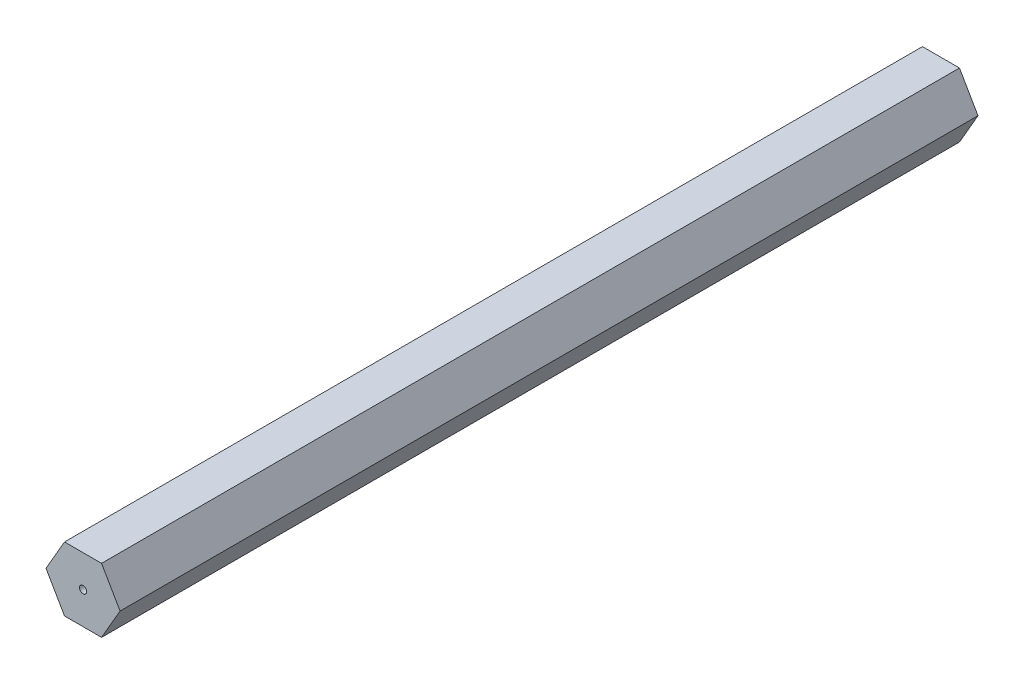
ISO-10303-21;
HEADER;
FILE_DESCRIPTION(('STEP AP214'),'2;1');
FILE_NAME('part.step','',(''),(''),'','','');
FILE_SCHEMA(('AUTOMOTIVE_DESIGN { 1 0 10303 214 1 1 1 1 }'));
ENDSEC;
DATA;
#1=APPLICATION_CONTEXT('core data for automotive mechanical design processes');
#2=APPLICATION_PROTOCOL_DEFINITION('international standard','automotive_design',2000,#1);
#3=PRODUCT_CONTEXT('',#1,'mechanical');
#4=PRODUCT('Part','Part','',(#3));
#5=PRODUCT_RELATED_PRODUCT_CATEGORY('part','',(#4));
#6=PRODUCT_DEFINITION_FORMATION('','',#4);
#7=PRODUCT_DEFINITION_CONTEXT('part definition',#1,'design');
#8=PRODUCT_DEFINITION('design','',#6,#7);
#9=PRODUCT_DEFINITION_SHAPE('','',#8);
#10=(LENGTH_UNIT() NAMED_UNIT(*) SI_UNIT(.MILLI.,.METRE.));
#11=(NAMED_UNIT(*) PLANE_ANGLE_UNIT() SI_UNIT($,.RADIAN.));
#12=(NAMED_UNIT(*) SI_UNIT($,.STERADIAN.) SOLID_ANGLE_UNIT());
#13=UNCERTAINTY_MEASURE_WITH_UNIT(LENGTH_MEASURE(1.E-05),#10,'distance_accuracy_value','');
#14=(GEOMETRIC_REPRESENTATION_CONTEXT(3) GLOBAL_UNCERTAINTY_ASSIGNED_CONTEXT((#13)) GLOBAL_UNIT_ASSIGNED_CONTEXT((#10,
#11,#12)) REPRESENTATION_CONTEXT('',''));
#15=CARTESIAN_POINT('',(0.,0.,0.));
#16=DIRECTION('',(0.,0.,1.));
#17=DIRECTION('',(1.,0.,0.));
#18=AXIS2_PLACEMENT_3D('',#15,#16,#17);
#19=CARTESIAN_POINT('',(-3.66617420935412,-6.35,169.8625));
#20=DIRECTION('',(0.,1.,0.));
#21=DIRECTION('',(0.,0.,1.));
#22=AXIS2_PLACEMENT_3D('',#19,#20,#21);
#23=PLANE('',#22);
#24=DIRECTION('',(1.,0.,0.));
#25=VECTOR('',#24,1.);
#26=CARTESIAN_POINT('',(-3.66617420935412,-6.35,0.));
#27=LINE('',#26,#25);
#28=CARTESIAN_POINT('',(-3.66617420935412,-6.35,0.));
#29=VERTEX_POINT('',#28);
#30=CARTESIAN_POINT('',(3.66617420935412,-6.35,0.));
#31=VERTEX_POINT('',#30);
#32=EDGE_CURVE('E118',#29,#31,#27,.T.);
#33=ORIENTED_EDGE('',*,*,#32,.T.);
#34=DIRECTION('',(0.,0.,-1.));
#35=VECTOR('',#34,1.);
#36=CARTESIAN_POINT('',(3.66617420935412,-6.35,169.8625));
#37=LINE('',#36,#35);
#38=CARTESIAN_POINT('',(3.66617420935412,-6.35,169.8625));
#39=VERTEX_POINT('',#38);
#40=EDGE_CURVE('E11',#39,#31,#37,.T.);
#41=ORIENTED_EDGE('',*,*,#40,.F.);
#42=DIRECTION('',(1.,0.,0.));
#43=VECTOR('',#42,1.);
#44=CARTESIAN_POINT('',(-3.66617420935412,-6.35,169.8625));
#45=LINE('',#44,#43);
#46=CARTESIAN_POINT('',(-3.66617420935412,-6.35,169.8625));
#47=VERTEX_POINT('',#46);
#48=EDGE_CURVE('E129',#47,#39,#45,.T.);
#49=ORIENTED_EDGE('',*,*,#48,.F.);
#50=DIRECTION('',(0.,0.,-1.));
#51=VECTOR('',#50,1.);
#52=CARTESIAN_POINT('',(-3.66617420935412,-6.35,169.8625));
#53=LINE('',#52,#51);
#54=EDGE_CURVE('E114',#47,#29,#53,.T.);
#55=ORIENTED_EDGE('',*,*,#54,.T.);
#56=EDGE_LOOP('',(#33,#41,#49,#55));
#57=FACE_BOUND('',#56,.T.);
#58=ADVANCED_FACE('F34',(#57),#23,.F.);
#59=CARTESIAN_POINT('',(3.66617420935412,-6.35,169.8625));
#60=DIRECTION('',(-0.866025403784439,0.5,0.));
#61=DIRECTION('',(-0.5,-0.866025403784439,0.));
#62=AXIS2_PLACEMENT_3D('',#59,#60,#61);
#63=PLANE('',#62);
#64=DIRECTION('',(0.5,0.866025403784439,0.));
#65=VECTOR('',#64,1.);
#66=CARTESIAN_POINT('',(3.66617420935412,-6.35,0.));
#67=LINE('',#66,#65);
#68=CARTESIAN_POINT('',(7.33234841870825,0.,0.));
#69=VERTEX_POINT('',#68);
#70=EDGE_CURVE('E121',#31,#69,#67,.T.);
#71=ORIENTED_EDGE('',*,*,#70,.T.);
#72=DIRECTION('',(0.,0.,-1.));
#73=VECTOR('',#72,1.);
#74=CARTESIAN_POINT('',(7.33234841870825,0.,169.8625));
#75=LINE('',#74,#73);
#76=CARTESIAN_POINT('',(7.33234841870825,0.,169.8625));
#77=VERTEX_POINT('',#76);
#78=EDGE_CURVE('E42',#77,#69,#75,.T.);
#79=ORIENTED_EDGE('',*,*,#78,.F.);
#80=DIRECTION('',(0.5,0.866025403784439,0.));
#81=VECTOR('',#80,1.);
#82=CARTESIAN_POINT('',(3.66617420935412,-6.35,169.8625));
#83=LINE('',#82,#81);
#84=EDGE_CURVE('E87',#39,#77,#83,.T.);
#85=ORIENTED_EDGE('',*,*,#84,.F.);
#86=ORIENTED_EDGE('',*,*,#40,.T.);
#87=EDGE_LOOP('',(#71,#79,#85,#86));
#88=FACE_BOUND('',#87,.T.);
#89=ADVANCED_FACE('F154',(#88),#63,.F.);
#90=CARTESIAN_POINT('',(7.33234841870825,0.,169.8625));
#91=DIRECTION('',(-0.866025403784438,-0.5,0.));
#92=DIRECTION('',(0.5,-0.866025403784438,0.));
#93=AXIS2_PLACEMENT_3D('',#90,#91,#92);
#94=PLANE('',#93);
#95=DIRECTION('',(-0.5,0.866025403784439,0.));
#96=VECTOR('',#95,1.);
#97=CARTESIAN_POINT('',(7.33234841870825,0.,0.));
#98=LINE('',#97,#96);
#99=CARTESIAN_POINT('',(3.66617420935412,6.35,0.));
#100=VERTEX_POINT('',#99);
#101=EDGE_CURVE('E124',#69,#100,#98,.T.);
#102=ORIENTED_EDGE('',*,*,#101,.T.);
#103=DIRECTION('',(0.,0.,-1.));
#104=VECTOR('',#103,1.);
#105=CARTESIAN_POINT('',(3.66617420935412,6.35,169.8625));
#106=LINE('',#105,#104);
#107=CARTESIAN_POINT('',(3.66617420935412,6.35,169.8625));
#108=VERTEX_POINT('',#107);
#109=EDGE_CURVE('E109',#108,#100,#106,.T.);
#110=ORIENTED_EDGE('',*,*,#109,.F.);
#111=DIRECTION('',(-0.5,0.866025403784439,0.));
#112=VECTOR('',#111,1.);
#113=CARTESIAN_POINT('',(7.33234841870825,0.,169.8625));
#114=LINE('',#113,#112);
#115=EDGE_CURVE('E100',#77,#108,#114,.T.);
#116=ORIENTED_EDGE('',*,*,#115,.F.);
#117=ORIENTED_EDGE('',*,*,#78,.T.);
#118=EDGE_LOOP('',(#102,#110,#116,#117));
#119=FACE_BOUND('',#118,.T.);
#120=ADVANCED_FACE('F135',(#119),#94,.F.);
#121=CARTESIAN_POINT('',(3.66617420935412,6.35,169.8625));
#122=DIRECTION('',(0.,-1.,0.));
#123=DIRECTION('',(1.,0.,0.));
#124=AXIS2_PLACEMENT_3D('',#121,#122,#123);
#125=PLANE('',#124);
#126=DIRECTION('',(-1.,0.,0.));
#127=VECTOR('',#126,1.);
#128=CARTESIAN_POINT('',(3.66617420935412,6.35,0.));
#129=LINE('',#128,#127);
#130=CARTESIAN_POINT('',(-3.66617420935413,6.35,0.));
#131=VERTEX_POINT('',#130);
#132=EDGE_CURVE('E108',#100,#131,#129,.T.);
#133=ORIENTED_EDGE('',*,*,#132,.T.);
#134=DIRECTION('',(0.,0.,-1.));
#135=VECTOR('',#134,1.);
#136=CARTESIAN_POINT('',(-3.66617420935413,6.35,169.8625));
#137=LINE('',#136,#135);
#138=CARTESIAN_POINT('',(-3.66617420935413,6.35,169.8625));
#139=VERTEX_POINT('',#138);
#140=EDGE_CURVE('E105',#139,#131,#137,.T.);
#141=ORIENTED_EDGE('',*,*,#140,.F.);
#142=DIRECTION('',(-1.,0.,0.));
#143=VECTOR('',#142,1.);
#144=CARTESIAN_POINT('',(3.66617420935412,6.35,169.8625));
#145=LINE('',#144,#143);
#146=EDGE_CURVE('E94',#108,#139,#145,.T.);
#147=ORIENTED_EDGE('',*,*,#146,.F.);
#148=ORIENTED_EDGE('',*,*,#109,.T.);
#149=EDGE_LOOP('',(#133,#141,#147,#148));
#150=FACE_BOUND('',#149,.T.);
#151=ADVANCED_FACE('F106',(#150),#125,.F.);
#152=CARTESIAN_POINT('',(-3.66617420935413,6.35,169.8625));
#153=DIRECTION('',(0.866025403784439,-0.5,0.));
#154=DIRECTION('',(0.5,0.866025403784439,0.));
#155=AXIS2_PLACEMENT_3D('',#152,#153,#154);
#156=PLANE('',#155);
#157=DIRECTION('',(-0.5,-0.866025403784439,0.));
#158=VECTOR('',#157,1.);
#159=CARTESIAN_POINT('',(-3.66617420935413,6.35,0.));
#160=LINE('',#159,#158);
#161=CARTESIAN_POINT('',(-7.33234841870825,0.,0.));
#162=VERTEX_POINT('',#161);
#163=EDGE_CURVE('E73',#131,#162,#160,.T.);
#164=ORIENTED_EDGE('',*,*,#163,.T.);
#165=DIRECTION('',(0.,0.,-1.));
#166=VECTOR('',#165,1.);
#167=CARTESIAN_POINT('',(-7.33234841870825,0.,169.8625));
#168=LINE('',#167,#166);
#169=CARTESIAN_POINT('',(-7.33234841870825,0.,169.8625));
#170=VERTEX_POINT('',#169);
#171=EDGE_CURVE('E110',#170,#162,#168,.T.);
#172=ORIENTED_EDGE('',*,*,#171,.F.);
#173=DIRECTION('',(-0.5,-0.866025403784439,0.));
#174=VECTOR('',#173,1.);
#175=CARTESIAN_POINT('',(-3.66617420935413,6.35,169.8625));
#176=LINE('',#175,#174);
#177=EDGE_CURVE('E98',#139,#170,#176,.T.);
#178=ORIENTED_EDGE('',*,*,#177,.F.);
#179=ORIENTED_EDGE('',*,*,#140,.T.);
#180=EDGE_LOOP('',(#164,#172,#178,#179));
#181=FACE_BOUND('',#180,.T.);
#182=ADVANCED_FACE('F112',(#181),#156,.F.);
#183=CARTESIAN_POINT('',(-7.33234841870825,0.,169.8625));
#184=DIRECTION('',(0.866025403784438,0.5,0.));
#185=DIRECTION('',(-0.5,0.866025403784439,0.));
#186=AXIS2_PLACEMENT_3D('',#183,#184,#185);
#187=PLANE('',#186);
#188=DIRECTION('',(0.5,-0.866025403784438,0.));
#189=VECTOR('',#188,1.);
#190=CARTESIAN_POINT('',(-7.33234841870825,0.,0.));
#191=LINE('',#190,#189);
#192=EDGE_CURVE('E79',#162,#29,#191,.T.);
#193=ORIENTED_EDGE('',*,*,#192,.T.);
#194=ORIENTED_EDGE('',*,*,#54,.F.);
#195=DIRECTION('',(0.5,-0.866025403784438,0.));
#196=VECTOR('',#195,1.);
#197=CARTESIAN_POINT('',(-7.33234841870825,0.,169.8625));
#198=LINE('',#197,#196);
#199=EDGE_CURVE('E50',#170,#47,#198,.T.);
#200=ORIENTED_EDGE('',*,*,#199,.F.);
#201=ORIENTED_EDGE('',*,*,#171,.T.);
#202=EDGE_LOOP('',(#193,#194,#200,#201));
#203=FACE_BOUND('',#202,.T.);
#204=ADVANCED_FACE('F142',(#203),#187,.F.);
#205=CARTESIAN_POINT('',(0.,0.,169.8625));
#206=DIRECTION('',(0.,0.,1.));
#207=DIRECTION('',(1.,0.,0.));
#208=AXIS2_PLACEMENT_3D('',#205,#206,#207);
#209=PLANE('',#208);
#210=CARTESIAN_POINT('',(0.,0.,169.8625));
#211=DIRECTION('',(0.,0.,1.));
#212=DIRECTION('',(1.,0.,0.));
#213=AXIS2_PLACEMENT_3D('',#210,#211,#212);
#214=CIRCLE('',#213,0.710047413350438);
#215=CARTESIAN_POINT('',(0.710047413350438,0.,169.8625));
#216=VERTEX_POINT('',#215);
#217=EDGE_CURVE('E209',#216,#216,#214,.T.);
#218=ORIENTED_EDGE('',*,*,#217,.F.);
#219=EDGE_LOOP('',(#218));
#220=FACE_BOUND('',#219,.T.);
#221=ORIENTED_EDGE('',*,*,#48,.T.);
#222=ORIENTED_EDGE('',*,*,#84,.T.);
#223=ORIENTED_EDGE('',*,*,#115,.T.);
#224=ORIENTED_EDGE('',*,*,#146,.T.);
#225=ORIENTED_EDGE('',*,*,#177,.T.);
#226=ORIENTED_EDGE('',*,*,#199,.T.);
#227=EDGE_LOOP('',(#221,#222,#223,#224,#225,#226));
#228=FACE_BOUND('',#227,.T.);
#229=ADVANCED_FACE('F96',(#220,#228),#209,.T.);
#230=CARTESIAN_POINT('',(0.,0.,0.));
#231=DIRECTION('',(0.,0.,1.));
#232=DIRECTION('',(1.,0.,0.));
#233=AXIS2_PLACEMENT_3D('',#230,#231,#232);
#234=PLANE('',#233);
#235=CARTESIAN_POINT('',(0.,0.,0.));
#236=DIRECTION('',(0.,0.,1.));
#237=DIRECTION('',(1.,0.,0.));
#238=AXIS2_PLACEMENT_3D('',#235,#236,#237);
#239=CIRCLE('',#238,0.710047413350438);
#240=CARTESIAN_POINT('',(0.710047413350438,0.,0.));
#241=VERTEX_POINT('',#240);
#242=EDGE_CURVE('E122',#241,#241,#239,.T.);
#243=ORIENTED_EDGE('',*,*,#242,.T.);
#244=EDGE_LOOP('',(#243));
#245=FACE_BOUND('',#244,.T.);
#246=ORIENTED_EDGE('',*,*,#32,.F.);
#247=ORIENTED_EDGE('',*,*,#192,.F.);
#248=ORIENTED_EDGE('',*,*,#163,.F.);
#249=ORIENTED_EDGE('',*,*,#132,.F.);
#250=ORIENTED_EDGE('',*,*,#101,.F.);
#251=ORIENTED_EDGE('',*,*,#70,.F.);
#252=EDGE_LOOP('',(#246,#247,#248,#249,#250,#251));
#253=FACE_BOUND('',#252,.T.);
#254=ADVANCED_FACE('F138',(#245,#253),#234,.F.);
#255=CARTESIAN_POINT('',(0.,0.,0.));
#256=DIRECTION('',(0.,0.,1.));
#257=DIRECTION('',(1.,0.,0.));
#258=AXIS2_PLACEMENT_3D('',#255,#256,#257);
#259=CYLINDRICAL_SURFACE('',#258,0.710047413350438);
#260=ORIENTED_EDGE('',*,*,#242,.F.);
#261=EDGE_LOOP('',(#260));
#262=FACE_BOUND('',#261,.T.);
#263=ORIENTED_EDGE('',*,*,#217,.T.);
#264=EDGE_LOOP('',(#263));
#265=FACE_BOUND('',#264,.T.);
#266=ADVANCED_FACE('F191',(#262,#265),#259,.F.);
#267=CLOSED_SHELL('',(#58,#89,#120,#151,#182,#204,#229,#254,#266));
#268=MANIFOLD_SOLID_BREP('B2',#267);
#269=ADVANCED_BREP_SHAPE_REPRESENTATION('',(#18,#268),#14);
#270=SHAPE_DEFINITION_REPRESENTATION(#9,#269);
ENDSEC;
END-ISO-10303-21;
